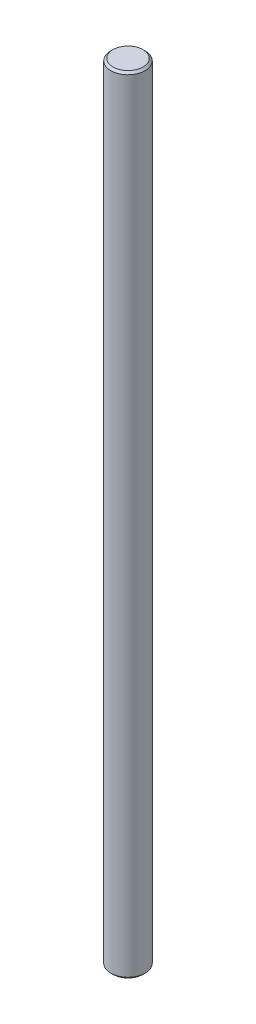
ISO-10303-21;
HEADER;
FILE_DESCRIPTION(('STEP AP214'),'2;1');
FILE_NAME('part.step','',(''),(''),'','','');
FILE_SCHEMA(('AUTOMOTIVE_DESIGN { 1 0 10303 214 1 1 1 1 }'));
ENDSEC;
DATA;
#1=APPLICATION_CONTEXT('core data for automotive mechanical design processes');
#2=APPLICATION_PROTOCOL_DEFINITION('international standard','automotive_design',2000,#1);
#3=PRODUCT_CONTEXT('',#1,'mechanical');
#4=PRODUCT('Part','Part','',(#3));
#5=PRODUCT_RELATED_PRODUCT_CATEGORY('part','',(#4));
#6=PRODUCT_DEFINITION_FORMATION('','',#4);
#7=PRODUCT_DEFINITION_CONTEXT('part definition',#1,'design');
#8=PRODUCT_DEFINITION('design','',#6,#7);
#9=PRODUCT_DEFINITION_SHAPE('','',#8);
#10=(LENGTH_UNIT() NAMED_UNIT(*) SI_UNIT(.MILLI.,.METRE.));
#11=(NAMED_UNIT(*) PLANE_ANGLE_UNIT() SI_UNIT($,.RADIAN.));
#12=(NAMED_UNIT(*) SI_UNIT($,.STERADIAN.) SOLID_ANGLE_UNIT());
#13=UNCERTAINTY_MEASURE_WITH_UNIT(LENGTH_MEASURE(1.E-05),#10,'distance_accuracy_value','');
#14=(GEOMETRIC_REPRESENTATION_CONTEXT(3) GLOBAL_UNCERTAINTY_ASSIGNED_CONTEXT((#13)) GLOBAL_UNIT_ASSIGNED_CONTEXT((#10,
#11,#12)) REPRESENTATION_CONTEXT('',''));
#15=CARTESIAN_POINT('',(0.,0.,0.));
#16=DIRECTION('',(0.,0.,1.));
#17=DIRECTION('',(1.,0.,0.));
#18=AXIS2_PLACEMENT_3D('',#15,#16,#17);
#19=CARTESIAN_POINT('',(0.,-183.,0.));
#20=DIRECTION('',(0.,1.,0.));
#21=DIRECTION('',(0.,0.,1.));
#22=AXIS2_PLACEMENT_3D('',#19,#20,#21);
#23=CONICAL_SURFACE('',#22,6.99999999999998,0.785398163397447);
#24=CARTESIAN_POINT('',(0.,-182.,0.));
#25=DIRECTION('',(0.,1.,0.));
#26=DIRECTION('',(0.,0.,1.));
#27=AXIS2_PLACEMENT_3D('',#24,#25,#26);
#28=CIRCLE('',#27,7.99999999999998);
#29=CARTESIAN_POINT('',(0.,-182.,7.99999999999998));
#30=VERTEX_POINT('',#29);
#31=EDGE_CURVE('E42',#30,#30,#28,.T.);
#32=ORIENTED_EDGE('',*,*,#31,.F.);
#33=EDGE_LOOP('',(#32));
#34=FACE_BOUND('',#33,.T.);
#35=CARTESIAN_POINT('',(0.,-183.,0.));
#36=DIRECTION('',(0.,1.,0.));
#37=DIRECTION('',(0.,0.,1.));
#38=AXIS2_PLACEMENT_3D('',#35,#36,#37);
#39=CIRCLE('',#38,6.99999999999998);
#40=CARTESIAN_POINT('',(0.,-183.,6.99999999999998));
#41=VERTEX_POINT('',#40);
#42=EDGE_CURVE('E10',#41,#41,#39,.T.);
#43=ORIENTED_EDGE('',*,*,#42,.T.);
#44=EDGE_LOOP('',(#43));
#45=FACE_BOUND('',#44,.T.);
#46=ADVANCED_FACE('F28',(#34,#45),#23,.T.);
#47=CARTESIAN_POINT('',(7.,-183.,0.));
#48=DIRECTION('',(0.,1.,0.));
#49=DIRECTION('',(0.,0.,1.));
#50=AXIS2_PLACEMENT_3D('',#47,#48,#49);
#51=PLANE('',#50);
#52=ORIENTED_EDGE('',*,*,#42,.F.);
#53=EDGE_LOOP('',(#52));
#54=FACE_BOUND('',#53,.T.);
#55=ADVANCED_FACE('F51',(#54),#51,.F.);
#56=CARTESIAN_POINT('',(7.,183.,0.));
#57=DIRECTION('',(0.,-1.,0.));
#58=DIRECTION('',(0.,0.,-1.));
#59=AXIS2_PLACEMENT_3D('',#56,#57,#58);
#60=PLANE('',#59);
#61=CARTESIAN_POINT('',(0.,183.,0.));
#62=DIRECTION('',(0.,1.,0.));
#63=DIRECTION('',(0.,0.,1.));
#64=AXIS2_PLACEMENT_3D('',#61,#62,#63);
#65=CIRCLE('',#64,6.99999999999998);
#66=CARTESIAN_POINT('',(0.,183.,6.99999999999998));
#67=VERTEX_POINT('',#66);
#68=EDGE_CURVE('E34',#67,#67,#65,.T.);
#69=ORIENTED_EDGE('',*,*,#68,.T.);
#70=EDGE_LOOP('',(#69));
#71=FACE_BOUND('',#70,.T.);
#72=ADVANCED_FACE('F55',(#71),#60,.F.);
#73=CARTESIAN_POINT('',(0.,182.,0.));
#74=DIRECTION('',(0.,-1.,0.));
#75=DIRECTION('',(0.,0.,-1.));
#76=AXIS2_PLACEMENT_3D('',#73,#74,#75);
#77=CONICAL_SURFACE('',#76,7.99999999999998,0.785398163397447);
#78=ORIENTED_EDGE('',*,*,#68,.F.);
#79=EDGE_LOOP('',(#78));
#80=FACE_BOUND('',#79,.T.);
#81=CARTESIAN_POINT('',(0.,182.,0.));
#82=DIRECTION('',(0.,1.,0.));
#83=DIRECTION('',(0.,0.,1.));
#84=AXIS2_PLACEMENT_3D('',#81,#82,#83);
#85=CIRCLE('',#84,7.99999999999998);
#86=CARTESIAN_POINT('',(0.,182.,7.99999999999998));
#87=VERTEX_POINT('',#86);
#88=EDGE_CURVE('E38',#87,#87,#85,.T.);
#89=ORIENTED_EDGE('',*,*,#88,.T.);
#90=EDGE_LOOP('',(#89));
#91=FACE_BOUND('',#90,.T.);
#92=ADVANCED_FACE('F60',(#80,#91),#77,.T.);
#93=CARTESIAN_POINT('',(0.,183.,0.));
#94=DIRECTION('',(0.,1.,0.));
#95=DIRECTION('',(0.,0.,1.));
#96=AXIS2_PLACEMENT_3D('',#93,#94,#95);
#97=CYLINDRICAL_SURFACE('',#96,7.99999999999998);
#98=ORIENTED_EDGE('',*,*,#88,.F.);
#99=EDGE_LOOP('',(#98));
#100=FACE_BOUND('',#99,.T.);
#101=ORIENTED_EDGE('',*,*,#31,.T.);
#102=EDGE_LOOP('',(#101));
#103=FACE_BOUND('',#102,.T.);
#104=ADVANCED_FACE('F48',(#100,#103),#97,.T.);
#105=CLOSED_SHELL('',(#46,#55,#72,#92,#104));
#106=MANIFOLD_SOLID_BREP('B2',#105);
#107=ADVANCED_BREP_SHAPE_REPRESENTATION('',(#18,#106),#14);
#108=SHAPE_DEFINITION_REPRESENTATION(#9,#107);
ENDSEC;
END-ISO-10303-21;
